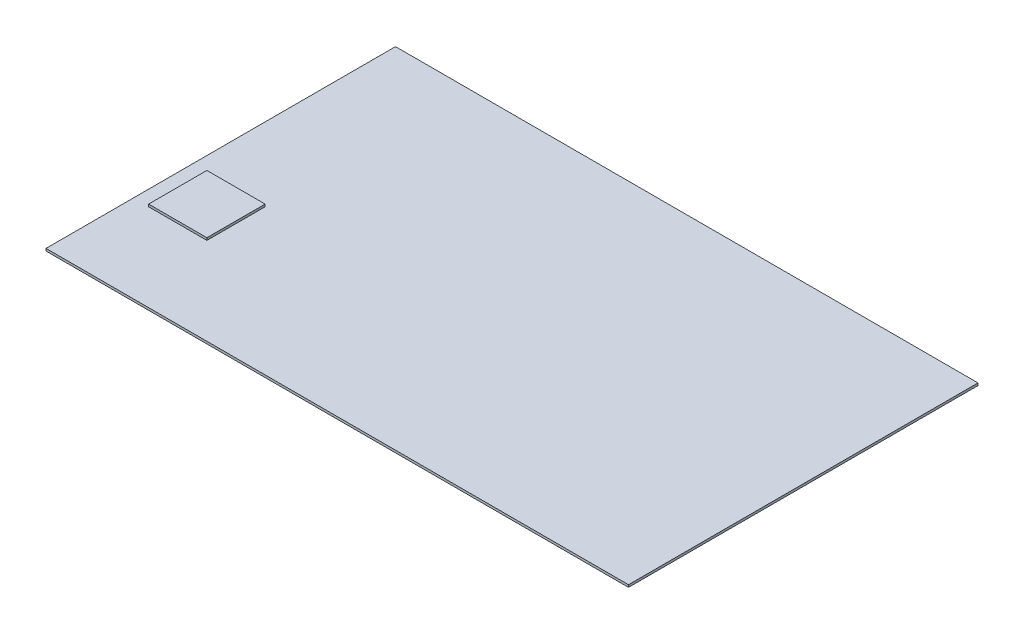
ISO-10303-21;
HEADER;
FILE_DESCRIPTION(('STEP AP214'),'2;1');
FILE_NAME('part.step','',(''),(''),'','','');
FILE_SCHEMA(('AUTOMOTIVE_DESIGN { 1 0 10303 214 1 1 1 1 }'));
ENDSEC;
DATA;
#1=APPLICATION_CONTEXT('core data for automotive mechanical design processes');
#2=APPLICATION_PROTOCOL_DEFINITION('international standard','automotive_design',2000,#1);
#3=PRODUCT_CONTEXT('',#1,'mechanical');
#4=PRODUCT('Part','Part','',(#3));
#5=PRODUCT_RELATED_PRODUCT_CATEGORY('part','',(#4));
#6=PRODUCT_DEFINITION_FORMATION('','',#4);
#7=PRODUCT_DEFINITION_CONTEXT('part definition',#1,'design');
#8=PRODUCT_DEFINITION('design','',#6,#7);
#9=PRODUCT_DEFINITION_SHAPE('','',#8);
#10=(LENGTH_UNIT() NAMED_UNIT(*) SI_UNIT(.MILLI.,.METRE.));
#11=(NAMED_UNIT(*) PLANE_ANGLE_UNIT() SI_UNIT($,.RADIAN.));
#12=(NAMED_UNIT(*) SI_UNIT($,.STERADIAN.) SOLID_ANGLE_UNIT());
#13=UNCERTAINTY_MEASURE_WITH_UNIT(LENGTH_MEASURE(1.E-05),#10,'distance_accuracy_value','');
#14=(GEOMETRIC_REPRESENTATION_CONTEXT(3) GLOBAL_UNCERTAINTY_ASSIGNED_CONTEXT((#13)) GLOBAL_UNIT_ASSIGNED_CONTEXT((#10,
#11,#12)) REPRESENTATION_CONTEXT('',''));
#15=CARTESIAN_POINT('',(0.,0.,0.));
#16=DIRECTION('',(0.,0.,1.));
#17=DIRECTION('',(1.,0.,0.));
#18=AXIS2_PLACEMENT_3D('',#15,#16,#17);
#19=CARTESIAN_POINT('',(0.,1.,0.));
#20=DIRECTION('',(0.,1.,0.));
#21=DIRECTION('',(0.,0.,1.));
#22=AXIS2_PLACEMENT_3D('',#19,#20,#21);
#23=PLANE('',#22);
#24=DIRECTION('',(0.,0.,1.));
#25=VECTOR('',#24,1.);
#26=CARTESIAN_POINT('',(-37.5457111623082,1.,-57.4523592162886));
#27=LINE('',#26,#25);
#28=CARTESIAN_POINT('',(-37.5457111623082,1.,-57.4523592162886));
#29=VERTEX_POINT('',#28);
#30=CARTESIAN_POINT('',(-37.5457111623082,1.,92.5476407837114));
#31=VERTEX_POINT('',#30);
#32=EDGE_CURVE('E140',#29,#31,#27,.T.);
#33=ORIENTED_EDGE('',*,*,#32,.T.);
#34=DIRECTION('',(1.,0.,0.));
#35=VECTOR('',#34,1.);
#36=CARTESIAN_POINT('',(-37.5457111623082,1.,92.5476407837114));
#37=LINE('',#36,#35);
#38=CARTESIAN_POINT('',(212.454288837692,1.,92.5476407837114));
#39=VERTEX_POINT('',#38);
#40=EDGE_CURVE('E85',#31,#39,#37,.T.);
#41=ORIENTED_EDGE('',*,*,#40,.T.);
#42=DIRECTION('',(0.,0.,-1.));
#43=VECTOR('',#42,1.);
#44=CARTESIAN_POINT('',(212.454288837692,1.,-57.4523592162886));
#45=LINE('',#44,#43);
#46=CARTESIAN_POINT('',(212.454288837692,1.,-57.4523592162886));
#47=VERTEX_POINT('',#46);
#48=EDGE_CURVE('E143',#39,#47,#45,.T.);
#49=ORIENTED_EDGE('',*,*,#48,.T.);
#50=DIRECTION('',(-1.,0.,0.));
#51=VECTOR('',#50,1.);
#52=CARTESIAN_POINT('',(-37.5457111623082,1.,-57.4523592162886));
#53=LINE('',#52,#51);
#54=EDGE_CURVE('E57',#47,#29,#53,.T.);
#55=ORIENTED_EDGE('',*,*,#54,.T.);
#56=EDGE_LOOP('',(#33,#41,#49,#55));
#57=FACE_BOUND('',#56,.T.);
#58=DIRECTION('',(-1.,0.,0.));
#59=VECTOR('',#58,1.);
#60=CARTESIAN_POINT('',(-5.99571116230819,1.,30.0476407837113));
#61=LINE('',#60,#59);
#62=CARTESIAN_POINT('',(-5.99571116230819,1.,30.0476407837113));
#63=VERTEX_POINT('',#62);
#64=CARTESIAN_POINT('',(-30.9957111623082,1.,30.0476407837114));
#65=VERTEX_POINT('',#64);
#66=EDGE_CURVE('E263',#63,#65,#61,.T.);
#67=ORIENTED_EDGE('',*,*,#66,.F.);
#68=DIRECTION('',(0.,0.,-1.));
#69=VECTOR('',#68,1.);
#70=CARTESIAN_POINT('',(-5.99571116230819,1.,30.0476407837113));
#71=LINE('',#70,#69);
#72=CARTESIAN_POINT('',(-5.99571116230818,1.,55.0476407837114));
#73=VERTEX_POINT('',#72);
#74=EDGE_CURVE('E130',#73,#63,#71,.T.);
#75=ORIENTED_EDGE('',*,*,#74,.F.);
#76=DIRECTION('',(1.,0.,0.));
#77=VECTOR('',#76,1.);
#78=CARTESIAN_POINT('',(-5.99571116230818,1.,55.0476407837114));
#79=LINE('',#78,#77);
#80=CARTESIAN_POINT('',(-30.9957111623082,1.,55.0476407837114));
#81=VERTEX_POINT('',#80);
#82=EDGE_CURVE('E126',#81,#73,#79,.T.);
#83=ORIENTED_EDGE('',*,*,#82,.F.);
#84=DIRECTION('',(0.,0.,1.));
#85=VECTOR('',#84,1.);
#86=CARTESIAN_POINT('',(-30.9957111623082,1.,30.0476407837114));
#87=LINE('',#86,#85);
#88=EDGE_CURVE('E260',#65,#81,#87,.T.);
#89=ORIENTED_EDGE('',*,*,#88,.F.);
#90=EDGE_LOOP('',(#67,#75,#83,#89));
#91=FACE_BOUND('',#90,.T.);
#92=ADVANCED_FACE('F33',(#57,#91),#23,.T.);
#93=CARTESIAN_POINT('',(-37.5457111623082,1.,-57.4523592162886));
#94=DIRECTION('',(1.,0.,0.));
#95=DIRECTION('',(0.,0.,-1.));
#96=AXIS2_PLACEMENT_3D('',#93,#94,#95);
#97=PLANE('',#96);
#98=DIRECTION('',(0.,0.,1.));
#99=VECTOR('',#98,1.);
#100=CARTESIAN_POINT('',(-37.5457111623082,0.,-57.4523592162886));
#101=LINE('',#100,#99);
#102=CARTESIAN_POINT('',(-37.5457111623082,0.,-57.4523592162886));
#103=VERTEX_POINT('',#102);
#104=CARTESIAN_POINT('',(-37.5457111623082,0.,92.5476407837114));
#105=VERTEX_POINT('',#104);
#106=EDGE_CURVE('E132',#103,#105,#101,.T.);
#107=ORIENTED_EDGE('',*,*,#106,.T.);
#108=DIRECTION('',(0.,-1.,0.));
#109=VECTOR('',#108,1.);
#110=CARTESIAN_POINT('',(-37.5457111623082,1.,92.5476407837114));
#111=LINE('',#110,#109);
#112=EDGE_CURVE('E11',#31,#105,#111,.T.);
#113=ORIENTED_EDGE('',*,*,#112,.F.);
#114=ORIENTED_EDGE('',*,*,#32,.F.);
#115=DIRECTION('',(0.,-1.,0.));
#116=VECTOR('',#115,1.);
#117=CARTESIAN_POINT('',(-37.5457111623082,1.,-57.4523592162886));
#118=LINE('',#117,#116);
#119=EDGE_CURVE('E145',#29,#103,#118,.T.);
#120=ORIENTED_EDGE('',*,*,#119,.T.);
#121=EDGE_LOOP('',(#107,#113,#114,#120));
#122=FACE_BOUND('',#121,.T.);
#123=ADVANCED_FACE('F35',(#122),#97,.F.);
#124=CARTESIAN_POINT('',(-37.5457111623082,1.,92.5476407837114));
#125=DIRECTION('',(0.,0.,-1.));
#126=DIRECTION('',(-1.,0.,0.));
#127=AXIS2_PLACEMENT_3D('',#124,#125,#126);
#128=PLANE('',#127);
#129=DIRECTION('',(1.,0.,0.));
#130=VECTOR('',#129,1.);
#131=CARTESIAN_POINT('',(-37.5457111623082,0.,92.5476407837114));
#132=LINE('',#131,#130);
#133=CARTESIAN_POINT('',(212.454288837692,0.,92.5476407837114));
#134=VERTEX_POINT('',#133);
#135=EDGE_CURVE('E135',#105,#134,#132,.T.);
#136=ORIENTED_EDGE('',*,*,#135,.T.);
#137=DIRECTION('',(0.,-1.,0.));
#138=VECTOR('',#137,1.);
#139=CARTESIAN_POINT('',(212.454288837692,1.,92.5476407837114));
#140=LINE('',#139,#138);
#141=EDGE_CURVE('E41',#39,#134,#140,.T.);
#142=ORIENTED_EDGE('',*,*,#141,.F.);
#143=ORIENTED_EDGE('',*,*,#40,.F.);
#144=ORIENTED_EDGE('',*,*,#112,.T.);
#145=EDGE_LOOP('',(#136,#142,#143,#144));
#146=FACE_BOUND('',#145,.T.);
#147=ADVANCED_FACE('F173',(#146),#128,.F.);
#148=CARTESIAN_POINT('',(212.454288837692,1.,-57.4523592162886));
#149=DIRECTION('',(-1.,0.,0.));
#150=DIRECTION('',(0.,0.,1.));
#151=AXIS2_PLACEMENT_3D('',#148,#149,#150);
#152=PLANE('',#151);
#153=DIRECTION('',(0.,0.,-1.));
#154=VECTOR('',#153,1.);
#155=CARTESIAN_POINT('',(212.454288837692,0.,-57.4523592162886));
#156=LINE('',#155,#154);
#157=CARTESIAN_POINT('',(212.454288837692,0.,-57.4523592162886));
#158=VERTEX_POINT('',#157);
#159=EDGE_CURVE('E148',#134,#158,#156,.T.);
#160=ORIENTED_EDGE('',*,*,#159,.T.);
#161=DIRECTION('',(0.,-1.,0.));
#162=VECTOR('',#161,1.);
#163=CARTESIAN_POINT('',(212.454288837692,1.,-57.4523592162886));
#164=LINE('',#163,#162);
#165=EDGE_CURVE('E152',#47,#158,#164,.T.);
#166=ORIENTED_EDGE('',*,*,#165,.F.);
#167=ORIENTED_EDGE('',*,*,#48,.F.);
#168=ORIENTED_EDGE('',*,*,#141,.T.);
#169=EDGE_LOOP('',(#160,#166,#167,#168));
#170=FACE_BOUND('',#169,.T.);
#171=ADVANCED_FACE('F157',(#170),#152,.F.);
#172=CARTESIAN_POINT('',(-37.5457111623082,1.,-57.4523592162886));
#173=DIRECTION('',(0.,0.,1.));
#174=DIRECTION('',(1.,0.,0.));
#175=AXIS2_PLACEMENT_3D('',#172,#173,#174);
#176=PLANE('',#175);
#177=DIRECTION('',(-1.,0.,0.));
#178=VECTOR('',#177,1.);
#179=CARTESIAN_POINT('',(-37.5457111623082,0.,-57.4523592162886));
#180=LINE('',#179,#178);
#181=EDGE_CURVE('E78',#158,#103,#180,.T.);
#182=ORIENTED_EDGE('',*,*,#181,.T.);
#183=ORIENTED_EDGE('',*,*,#119,.F.);
#184=ORIENTED_EDGE('',*,*,#54,.F.);
#185=ORIENTED_EDGE('',*,*,#165,.T.);
#186=EDGE_LOOP('',(#182,#183,#184,#185));
#187=FACE_BOUND('',#186,.T.);
#188=ADVANCED_FACE('F165',(#187),#176,.F.);
#189=CARTESIAN_POINT('',(0.,0.,0.));
#190=DIRECTION('',(0.,1.,0.));
#191=DIRECTION('',(0.,0.,1.));
#192=AXIS2_PLACEMENT_3D('',#189,#190,#191);
#193=PLANE('',#192);
#194=ORIENTED_EDGE('',*,*,#106,.F.);
#195=ORIENTED_EDGE('',*,*,#181,.F.);
#196=ORIENTED_EDGE('',*,*,#159,.F.);
#197=ORIENTED_EDGE('',*,*,#135,.F.);
#198=EDGE_LOOP('',(#194,#195,#196,#197));
#199=FACE_BOUND('',#198,.T.);
#200=ADVANCED_FACE('F161',(#199),#193,.F.);
#201=CARTESIAN_POINT('',(-5.99571116230819,2.,30.0476407837113));
#202=DIRECTION('',(-1.,0.,0.));
#203=DIRECTION('',(0.,0.,1.));
#204=AXIS2_PLACEMENT_3D('',#201,#202,#203);
#205=PLANE('',#204);
#206=ORIENTED_EDGE('',*,*,#74,.T.);
#207=DIRECTION('',(0.,-1.,0.));
#208=VECTOR('',#207,1.);
#209=CARTESIAN_POINT('',(-5.99571116230819,2.,30.0476407837113));
#210=LINE('',#209,#208);
#211=CARTESIAN_POINT('',(-5.99571116230819,2.,30.0476407837113));
#212=VERTEX_POINT('',#211);
#213=EDGE_CURVE('E111',#212,#63,#210,.T.);
#214=ORIENTED_EDGE('',*,*,#213,.F.);
#215=DIRECTION('',(0.,0.,-1.));
#216=VECTOR('',#215,1.);
#217=CARTESIAN_POINT('',(-5.99571116230819,2.,30.0476407837113));
#218=LINE('',#217,#216);
#219=CARTESIAN_POINT('',(-5.99571116230818,2.,55.0476407837114));
#220=VERTEX_POINT('',#219);
#221=EDGE_CURVE('E118',#220,#212,#218,.T.);
#222=ORIENTED_EDGE('',*,*,#221,.F.);
#223=DIRECTION('',(0.,-1.,0.));
#224=VECTOR('',#223,1.);
#225=CARTESIAN_POINT('',(-5.99571116230818,2.,55.0476407837114));
#226=LINE('',#225,#224);
#227=EDGE_CURVE('E258',#220,#73,#226,.T.);
#228=ORIENTED_EDGE('',*,*,#227,.T.);
#229=EDGE_LOOP('',(#206,#214,#222,#228));
#230=FACE_BOUND('',#229,.T.);
#231=ADVANCED_FACE('F128',(#230),#205,.F.);
#232=CARTESIAN_POINT('',(-5.99571116230819,2.,30.0476407837113));
#233=DIRECTION('',(0.,0.,1.));
#234=DIRECTION('',(1.,0.,0.));
#235=AXIS2_PLACEMENT_3D('',#232,#233,#234);
#236=PLANE('',#235);
#237=ORIENTED_EDGE('',*,*,#66,.T.);
#238=DIRECTION('',(0.,-1.,0.));
#239=VECTOR('',#238,1.);
#240=CARTESIAN_POINT('',(-30.9957111623082,2.,30.0476407837114));
#241=LINE('',#240,#239);
#242=CARTESIAN_POINT('',(-30.9957111623082,2.,30.0476407837114));
#243=VERTEX_POINT('',#242);
#244=EDGE_CURVE('E114',#243,#65,#241,.T.);
#245=ORIENTED_EDGE('',*,*,#244,.F.);
#246=DIRECTION('',(-1.,0.,0.));
#247=VECTOR('',#246,1.);
#248=CARTESIAN_POINT('',(-5.99571116230819,2.,30.0476407837113));
#249=LINE('',#248,#247);
#250=EDGE_CURVE('E107',#212,#243,#249,.T.);
#251=ORIENTED_EDGE('',*,*,#250,.F.);
#252=ORIENTED_EDGE('',*,*,#213,.T.);
#253=EDGE_LOOP('',(#237,#245,#251,#252));
#254=FACE_BOUND('',#253,.T.);
#255=ADVANCED_FACE('F109',(#254),#236,.F.);
#256=CARTESIAN_POINT('',(-30.9957111623082,2.,30.0476407837114));
#257=DIRECTION('',(1.,0.,0.));
#258=DIRECTION('',(0.,0.,-1.));
#259=AXIS2_PLACEMENT_3D('',#256,#257,#258);
#260=PLANE('',#259);
#261=ORIENTED_EDGE('',*,*,#88,.T.);
#262=DIRECTION('',(0.,-1.,0.));
#263=VECTOR('',#262,1.);
#264=CARTESIAN_POINT('',(-30.9957111623082,2.,55.0476407837114));
#265=LINE('',#264,#263);
#266=CARTESIAN_POINT('',(-30.9957111623082,2.,55.0476407837114));
#267=VERTEX_POINT('',#266);
#268=EDGE_CURVE('E48',#267,#81,#265,.T.);
#269=ORIENTED_EDGE('',*,*,#268,.F.);
#270=DIRECTION('',(0.,0.,1.));
#271=VECTOR('',#270,1.);
#272=CARTESIAN_POINT('',(-30.9957111623082,2.,30.0476407837114));
#273=LINE('',#272,#271);
#274=EDGE_CURVE('E117',#243,#267,#273,.T.);
#275=ORIENTED_EDGE('',*,*,#274,.F.);
#276=ORIENTED_EDGE('',*,*,#244,.T.);
#277=EDGE_LOOP('',(#261,#269,#275,#276));
#278=FACE_BOUND('',#277,.T.);
#279=ADVANCED_FACE('F186',(#278),#260,.F.);
#280=CARTESIAN_POINT('',(-5.99571116230818,2.,55.0476407837114));
#281=DIRECTION('',(0.,0.,-1.));
#282=DIRECTION('',(-1.,0.,0.));
#283=AXIS2_PLACEMENT_3D('',#280,#281,#282);
#284=PLANE('',#283);
#285=ORIENTED_EDGE('',*,*,#82,.T.);
#286=ORIENTED_EDGE('',*,*,#227,.F.);
#287=DIRECTION('',(1.,0.,0.));
#288=VECTOR('',#287,1.);
#289=CARTESIAN_POINT('',(-5.99571116230818,2.,55.0476407837114));
#290=LINE('',#289,#288);
#291=EDGE_CURVE('E122',#267,#220,#290,.T.);
#292=ORIENTED_EDGE('',*,*,#291,.F.);
#293=ORIENTED_EDGE('',*,*,#268,.T.);
#294=EDGE_LOOP('',(#285,#286,#292,#293));
#295=FACE_BOUND('',#294,.T.);
#296=ADVANCED_FACE('F189',(#295),#284,.F.);
#297=CARTESIAN_POINT('',(0.,2.,0.));
#298=DIRECTION('',(0.,-1.,0.));
#299=DIRECTION('',(0.,0.,-1.));
#300=AXIS2_PLACEMENT_3D('',#297,#298,#299);
#301=PLANE('',#300);
#302=ORIENTED_EDGE('',*,*,#221,.T.);
#303=ORIENTED_EDGE('',*,*,#250,.T.);
#304=ORIENTED_EDGE('',*,*,#274,.T.);
#305=ORIENTED_EDGE('',*,*,#291,.T.);
#306=EDGE_LOOP('',(#302,#303,#304,#305));
#307=FACE_BOUND('',#306,.T.);
#308=ADVANCED_FACE('F121',(#307),#301,.F.);
#309=CLOSED_SHELL('',(#92,#123,#147,#171,#188,#200,#231,#255,#279,#296,#308));
#310=MANIFOLD_SOLID_BREP('B2',#309);
#311=ADVANCED_BREP_SHAPE_REPRESENTATION('',(#18,#310),#14);
#312=SHAPE_DEFINITION_REPRESENTATION(#9,#311);
ENDSEC;
END-ISO-10303-21;
